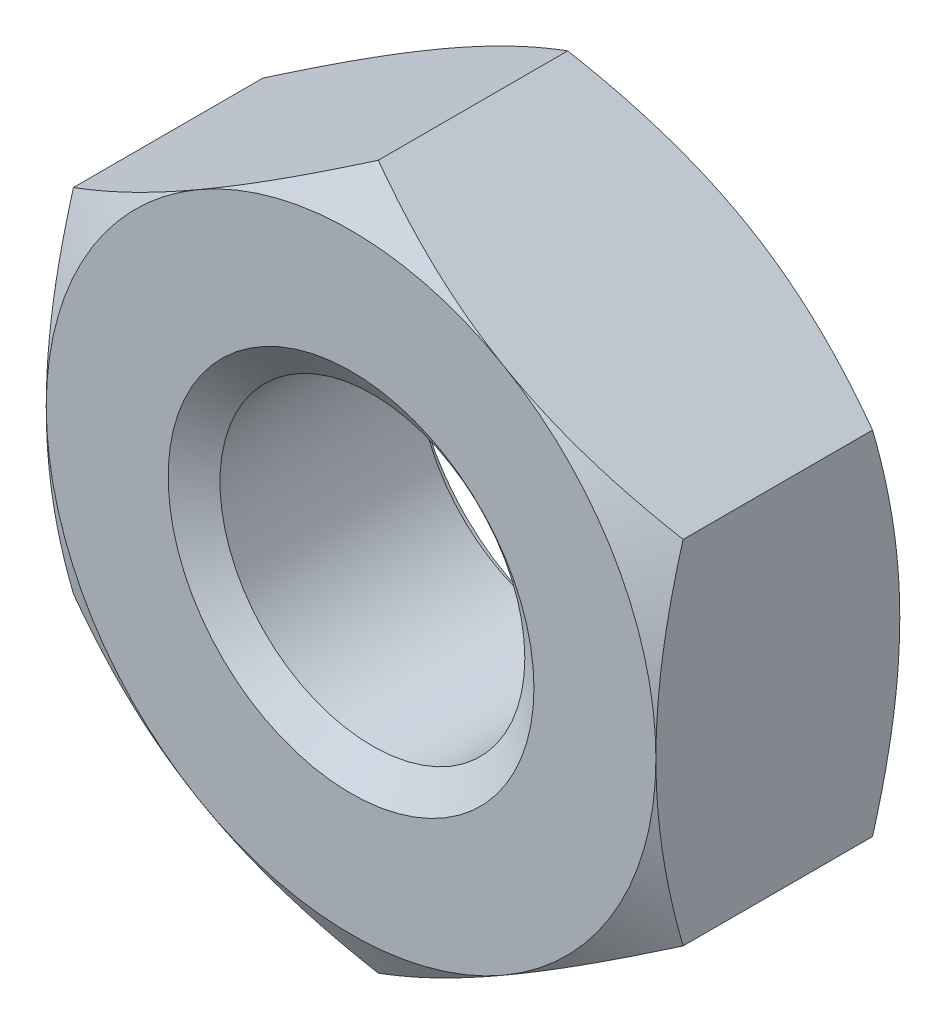
ISO-10303-21;
HEADER;
FILE_DESCRIPTION(('STEP AP214'),'2;1');
FILE_NAME('part.step','',(''),(''),'','','');
FILE_SCHEMA(('AUTOMOTIVE_DESIGN { 1 0 10303 214 1 1 1 1 }'));
ENDSEC;
DATA;
#1=APPLICATION_CONTEXT('core data for automotive mechanical design processes');
#2=APPLICATION_PROTOCOL_DEFINITION('international standard','automotive_design',2000,#1);
#3=PRODUCT_CONTEXT('',#1,'mechanical');
#4=PRODUCT('Part','Part','',(#3));
#5=PRODUCT_RELATED_PRODUCT_CATEGORY('part','',(#4));
#6=PRODUCT_DEFINITION_FORMATION('','',#4);
#7=PRODUCT_DEFINITION_CONTEXT('part definition',#1,'design');
#8=PRODUCT_DEFINITION('design','',#6,#7);
#9=PRODUCT_DEFINITION_SHAPE('','',#8);
#10=(LENGTH_UNIT() NAMED_UNIT(*) SI_UNIT(.MILLI.,.METRE.));
#11=(NAMED_UNIT(*) PLANE_ANGLE_UNIT() SI_UNIT($,.RADIAN.));
#12=(NAMED_UNIT(*) SI_UNIT($,.STERADIAN.) SOLID_ANGLE_UNIT());
#13=UNCERTAINTY_MEASURE_WITH_UNIT(LENGTH_MEASURE(1.E-05),#10,'distance_accuracy_value','');
#14=(GEOMETRIC_REPRESENTATION_CONTEXT(3) GLOBAL_UNCERTAINTY_ASSIGNED_CONTEXT((#13)) GLOBAL_UNIT_ASSIGNED_CONTEXT((#10,
#11,#12)) REPRESENTATION_CONTEXT('',''));
#15=CARTESIAN_POINT('',(0.,0.,0.));
#16=DIRECTION('',(0.,0.,1.));
#17=DIRECTION('',(1.,0.,0.));
#18=AXIS2_PLACEMENT_3D('',#15,#16,#17);
#19=CARTESIAN_POINT('',(0.,0.,-2.));
#20=DIRECTION('',(0.,0.,1.));
#21=DIRECTION('',(1.,0.,0.));
#22=AXIS2_PLACEMENT_3D('',#19,#20,#21);
#23=CYLINDRICAL_SURFACE('',#22,1.25);
#24=CARTESIAN_POINT('',(0.,0.,-0.175051884552426));
#25=DIRECTION('',(0.,0.,1.));
#26=DIRECTION('',(1.,0.,0.));
#27=AXIS2_PLACEMENT_3D('',#24,#25,#26);
#28=CIRCLE('',#27,1.25);
#29=CARTESIAN_POINT('',(1.25,0.,-0.175051884552426));
#30=VERTEX_POINT('',#29);
#31=EDGE_CURVE('E177',#30,#30,#28,.F.);
#32=ORIENTED_EDGE('',*,*,#31,.F.);
#33=EDGE_LOOP('',(#32));
#34=FACE_BOUND('',#33,.T.);
#35=CARTESIAN_POINT('',(0.,0.,-1.79954811544757));
#36=DIRECTION('',(0.,0.,-1.));
#37=DIRECTION('',(-1.,0.,0.));
#38=AXIS2_PLACEMENT_3D('',#35,#36,#37);
#39=CIRCLE('',#38,1.25);
#40=CARTESIAN_POINT('',(-1.25,0.,-1.79954811544757));
#41=VERTEX_POINT('',#40);
#42=EDGE_CURVE('E41',#41,#41,#39,.F.);
#43=ORIENTED_EDGE('',*,*,#42,.F.);
#44=EDGE_LOOP('',(#43));
#45=FACE_BOUND('',#44,.T.);
#46=ADVANCED_FACE('F36',(#34,#45),#23,.F.);
#47=CARTESIAN_POINT('',(0.,2.88675134594813,-2.));
#48=DIRECTION('',(-0.500000000000001,0.866025403784438,0.));
#49=DIRECTION('',(-0.866025403784438,-0.500000000000001,0.));
#50=AXIS2_PLACEMENT_3D('',#47,#48,#49);
#51=PLANE('',#50);
#52=DIRECTION('',(0.,0.,1.));
#53=VECTOR('',#52,1.);
#54=CARTESIAN_POINT('',(-2.5,1.44337567297406,-2.));
#55=LINE('',#54,#53);
#56=CARTESIAN_POINT('',(-2.5,1.44337567297407,-1.7767090063074));
#57=VERTEX_POINT('',#56);
#58=CARTESIAN_POINT('',(-2.5,1.44337567297406,-0.223290993692602));
#59=VERTEX_POINT('',#58);
#60=EDGE_CURVE('E167',#57,#59,#55,.T.);
#61=ORIENTED_EDGE('',*,*,#60,.T.);
#62=CARTESIAN_POINT('',(-2.5002,1.44326020292022,-0.223357664359109));
#63=CARTESIAN_POINT('',(-2.39033676526513,1.50668977106845,-0.186721620107627));
#64=CARTESIAN_POINT('',(-2.27952520010347,1.57066685804385,-0.153402218965057));
#65=CARTESIAN_POINT('',(-2.05598316653395,1.69972891130041,-0.0952422855578579));
#66=CARTESIAN_POINT('',(-1.94324872547161,1.7648161711947,-0.0704223291477382));
#67=CARTESIAN_POINT('',(-1.71917700612473,1.8941840386774,-0.0317856514410517));
#68=CARTESIAN_POINT('',(-1.60787420823262,1.95844473900197,-0.0177117961856387));
#69=CARTESIAN_POINT('',(-1.38474477253167,2.08726857876804,-0.000909152352750115));
#70=CARTESIAN_POINT('',(-1.27291894598577,2.15183124982667,0.00183354879637339));
#71=CARTESIAN_POINT('',(-1.06395802444848,2.27247489412634,-0.00386576000805381));
#72=CARTESIAN_POINT('',(-0.966791682442269,2.32857390783979,-0.0109083943818621));
#73=CARTESIAN_POINT('',(-0.773092050288998,2.44040644260542,-0.0332314191249433));
#74=CARTESIAN_POINT('',(-0.676559430340268,2.4961395767184,-0.048519438440268));
#75=CARTESIAN_POINT('',(-0.482460278259524,2.60820277442169,-0.0867390938444216));
#76=CARTESIAN_POINT('',(-0.384918318217859,2.66451865130903,-0.109832776125519));
#77=CARTESIAN_POINT('',(-0.191289391923915,2.77631036402774,-0.162246656577915));
#78=CARTESIAN_POINT('',(-0.0951999441138239,2.83178763258718,-0.191554535624551));
#79=CARTESIAN_POINT('',(0.000200000000000058,2.88686681600197,-0.223357664359111));
#80=B_SPLINE_CURVE_WITH_KNOTS('',3,(#62,#63,#64,#65,#66,#67,#68,#69,#70,#71,#72,#73,#74,#75,#76,
#77,#78,#79),.UNSPECIFIED.,.F.,.F.,(4,2,2,2,2,2,2,2,4),(0.,0.396285827362227,0.793524330152052,
1.18093086852114,1.56786160134475,1.90479741793733,2.24204551660463,2.58677531536756,
2.93082800105257),.UNSPECIFIED.);
#81=CARTESIAN_POINT('',(-1.25,2.1650635094611,0.));
#82=VERTEX_POINT('',#81);
#83=EDGE_CURVE('E63',#59,#82,#80,.T.);
#84=ORIENTED_EDGE('',*,*,#83,.T.);
#85=CARTESIAN_POINT('',(0.,2.88675134594813,-0.223290993692604));
#86=VERTEX_POINT('',#85);
#87=EDGE_CURVE('E246',#82,#86,#80,.T.);
#88=ORIENTED_EDGE('',*,*,#87,.T.);
#89=DIRECTION('',(0.,0.,1.));
#90=VECTOR('',#89,1.);
#91=CARTESIAN_POINT('',(0.,2.88675134594813,-2.));
#92=LINE('',#91,#90);
#93=CARTESIAN_POINT('',(0.,2.88675134594813,-1.7767090063074));
#94=VERTEX_POINT('',#93);
#95=EDGE_CURVE('E152',#94,#86,#92,.T.);
#96=ORIENTED_EDGE('',*,*,#95,.F.);
#97=CARTESIAN_POINT('',(-2.5002,1.44326020292022,-1.77664233564089));
#98=CARTESIAN_POINT('',(-2.39033676526513,1.50668977106845,-1.81327837989237));
#99=CARTESIAN_POINT('',(-2.27952520010348,1.57066685804385,-1.84659778103494));
#100=CARTESIAN_POINT('',(-2.05598316653395,1.69972891130041,-1.90475771444214));
#101=CARTESIAN_POINT('',(-1.94324872547161,1.7648161711947,-1.92957767085226));
#102=CARTESIAN_POINT('',(-1.71917700612473,1.8941840386774,-1.96821434855895));
#103=CARTESIAN_POINT('',(-1.60787420823262,1.95844473900197,-1.98228820381436));
#104=CARTESIAN_POINT('',(-1.38474477253167,2.08726857876804,-1.99909084764725));
#105=CARTESIAN_POINT('',(-1.27291894598577,2.15183124982667,-2.00183354879637));
#106=CARTESIAN_POINT('',(-1.06395802444848,2.27247489412634,-1.99613423999195));
#107=CARTESIAN_POINT('',(-0.966791682442269,2.32857390783979,-1.98909160561814));
#108=CARTESIAN_POINT('',(-0.773092050288998,2.44040644260542,-1.96676858087506));
#109=CARTESIAN_POINT('',(-0.676559430340268,2.4961395767184,-1.95148056155973));
#110=CARTESIAN_POINT('',(-0.482460278259524,2.60820277442169,-1.91326090615558));
#111=CARTESIAN_POINT('',(-0.384918318217859,2.66451865130903,-1.89016722387448));
#112=CARTESIAN_POINT('',(-0.191289391923915,2.77631036402774,-1.83775334342208));
#113=CARTESIAN_POINT('',(-0.095199944113824,2.83178763258718,-1.80844546437545));
#114=CARTESIAN_POINT('',(0.000200000000000049,2.88686681600197,-1.77664233564089));
#115=B_SPLINE_CURVE_WITH_KNOTS('',3,(#97,#98,#99,#100,#101,#102,#103,#104,#105,#106,#107,#108,
#109,#110,#111,#112,#113,#114),.UNSPECIFIED.,.F.,.F.,(4,2,2,2,2,2,2,2,4),(0.,0.396285827362227,
0.793524330152052,1.18093086852114,1.56786160134476,1.90479741793733,2.24204551660463,
2.58677531536756,2.93082800105257),.UNSPECIFIED.);
#116=CARTESIAN_POINT('',(-1.25,2.1650635094611,-2.));
#117=VERTEX_POINT('',#116);
#118=EDGE_CURVE('E170',#117,#94,#115,.T.);
#119=ORIENTED_EDGE('',*,*,#118,.F.);
#120=EDGE_CURVE('E269',#57,#117,#115,.T.);
#121=ORIENTED_EDGE('',*,*,#120,.F.);
#122=EDGE_LOOP('',(#61,#84,#88,#96,#119,#121));
#123=FACE_BOUND('',#122,.T.);
#124=ADVANCED_FACE('F38',(#123),#51,.T.);
#125=CARTESIAN_POINT('',(2.5,1.44337567297406,-2.));
#126=DIRECTION('',(0.500000000000001,0.866025403784438,0.));
#127=DIRECTION('',(-0.866025403784438,0.500000000000001,0.));
#128=AXIS2_PLACEMENT_3D('',#125,#126,#127);
#129=PLANE('',#128);
#130=ORIENTED_EDGE('',*,*,#95,.T.);
#131=CARTESIAN_POINT('',(-0.000200000000000063,2.88686681600197,-0.223357664359111));
#132=CARTESIAN_POINT('',(0.109663234734871,2.82343724785375,-0.186721620107628));
#133=CARTESIAN_POINT('',(0.220474799896526,2.75946016087834,-0.153402218965058));
#134=CARTESIAN_POINT('',(0.44401683346605,2.63039810762178,-0.0952422855578591));
#135=CARTESIAN_POINT('',(0.556751274528389,2.5653108477275,-0.0704223291477395));
#136=CARTESIAN_POINT('',(0.78082299387527,2.43594298024479,-0.0317856514410527));
#137=CARTESIAN_POINT('',(0.892125791767378,2.37168227992023,-0.0177117961856393));
#138=CARTESIAN_POINT('',(1.11525522746833,2.24285844015415,-0.000909152352750227));
#139=CARTESIAN_POINT('',(1.22708105401423,2.17829576909553,0.00183354879637344));
#140=CARTESIAN_POINT('',(1.43604197555152,2.05765212479586,-0.00386576000805338));
#141=CARTESIAN_POINT('',(1.53320831755773,2.0015531110824,-0.0109083943818615));
#142=CARTESIAN_POINT('',(1.726907949711,1.88972057631678,-0.0332314191249424));
#143=CARTESIAN_POINT('',(1.82344056965973,1.8339874422038,-0.0485194384402671));
#144=CARTESIAN_POINT('',(2.01753972174048,1.7219242445005,-0.0867390938444205));
#145=CARTESIAN_POINT('',(2.11508168178214,1.66560836761316,-0.109832776125517));
#146=CARTESIAN_POINT('',(2.30871060807609,1.55381665489445,-0.162246656577914));
#147=CARTESIAN_POINT('',(2.40480005588618,1.49833938633502,-0.191554535624549));
#148=CARTESIAN_POINT('',(2.5002,1.44326020292022,-0.223357664359109));
#149=B_SPLINE_CURVE_WITH_KNOTS('',3,(#131,#132,#133,#134,#135,#136,#137,#138,#139,#140,#141,
#142,#143,#144,#145,#146,#147,#148),.UNSPECIFIED.,.F.,.F.,(4,2,2,2,2,2,2,2,4),(0.,
0.396285827362228,0.793524330152053,1.18093086852114,1.56786160134476,1.90479741793733,
2.24204551660463,2.58677531536756,2.93082800105257),.UNSPECIFIED.);
#150=CARTESIAN_POINT('',(1.25,2.1650635094611,0.));
#151=VERTEX_POINT('',#150);
#152=EDGE_CURVE('E145',#86,#151,#149,.T.);
#153=ORIENTED_EDGE('',*,*,#152,.T.);
#154=CARTESIAN_POINT('',(2.5,1.44337567297407,-0.223290993692604));
#155=VERTEX_POINT('',#154);
#156=EDGE_CURVE('E131',#151,#155,#149,.T.);
#157=ORIENTED_EDGE('',*,*,#156,.T.);
#158=DIRECTION('',(0.,0.,1.));
#159=VECTOR('',#158,1.);
#160=CARTESIAN_POINT('',(2.5,1.44337567297406,-2.));
#161=LINE('',#160,#159);
#162=CARTESIAN_POINT('',(2.5,1.44337567297407,-1.7767090063074));
#163=VERTEX_POINT('',#162);
#164=EDGE_CURVE('E144',#163,#155,#161,.T.);
#165=ORIENTED_EDGE('',*,*,#164,.F.);
#166=CARTESIAN_POINT('',(-0.000200000000000063,2.88686681600197,-1.77664233564089));
#167=CARTESIAN_POINT('',(0.109663234734871,2.82343724785375,-1.81327837989237));
#168=CARTESIAN_POINT('',(0.220474799896526,2.75946016087834,-1.84659778103494));
#169=CARTESIAN_POINT('',(0.44401683346605,2.63039810762178,-1.90475771444214));
#170=CARTESIAN_POINT('',(0.556751274528389,2.5653108477275,-1.92957767085226));
#171=CARTESIAN_POINT('',(0.780822993875269,2.43594298024479,-1.96821434855895));
#172=CARTESIAN_POINT('',(0.892125791767378,2.37168227992023,-1.98228820381436));
#173=CARTESIAN_POINT('',(1.11525522746833,2.24285844015415,-1.99909084764725));
#174=CARTESIAN_POINT('',(1.22708105401423,2.17829576909553,-2.00183354879637));
#175=CARTESIAN_POINT('',(1.43604197555152,2.05765212479586,-1.99613423999195));
#176=CARTESIAN_POINT('',(1.53320831755773,2.0015531110824,-1.98909160561814));
#177=CARTESIAN_POINT('',(1.726907949711,1.88972057631678,-1.96676858087506));
#178=CARTESIAN_POINT('',(1.82344056965973,1.8339874422038,-1.95148056155973));
#179=CARTESIAN_POINT('',(2.01753972174048,1.7219242445005,-1.91326090615558));
#180=CARTESIAN_POINT('',(2.11508168178214,1.66560836761316,-1.89016722387448));
#181=CARTESIAN_POINT('',(2.30871060807609,1.55381665489445,-1.83775334342209));
#182=CARTESIAN_POINT('',(2.40480005588618,1.49833938633502,-1.80844546437545));
#183=CARTESIAN_POINT('',(2.5002,1.44326020292022,-1.77664233564089));
#184=B_SPLINE_CURVE_WITH_KNOTS('',3,(#166,#167,#168,#169,#170,#171,#172,#173,#174,#175,#176,
#177,#178,#179,#180,#181,#182,#183),.UNSPECIFIED.,.F.,.F.,(4,2,2,2,2,2,2,2,4),(0.,
0.396285827362228,0.793524330152053,1.18093086852114,1.56786160134476,1.90479741793733,
2.24204551660463,2.58677531536756,2.93082800105257),.UNSPECIFIED.);
#185=CARTESIAN_POINT('',(1.25,2.1650635094611,-2.));
#186=VERTEX_POINT('',#185);
#187=EDGE_CURVE('E262',#186,#163,#184,.T.);
#188=ORIENTED_EDGE('',*,*,#187,.F.);
#189=EDGE_CURVE('E268',#94,#186,#184,.T.);
#190=ORIENTED_EDGE('',*,*,#189,.F.);
#191=EDGE_LOOP('',(#130,#153,#157,#165,#188,#190));
#192=FACE_BOUND('',#191,.T.);
#193=ADVANCED_FACE('F142',(#192),#129,.T.);
#194=CARTESIAN_POINT('',(2.5,1.44337567297406,-2.));
#195=DIRECTION('',(-1.,0.,0.));
#196=DIRECTION('',(0.,0.,1.));
#197=AXIS2_PLACEMENT_3D('',#194,#195,#196);
#198=PLANE('',#197);
#199=CARTESIAN_POINT('',(2.5,-3.82804499372433,-1.1963167632754));
#200=CARTESIAN_POINT('',(2.5,-3.71828085649173,-1.14327266922931));
#201=CARTESIAN_POINT('',(2.5,-3.60825720059554,-1.09075587737963));
#202=CARTESIAN_POINT('',(2.5,-3.38755052986222,-0.987078216748229));
#203=CARTESIAN_POINT('',(2.5,-3.27686740487455,-0.935917582729521));
#204=CARTESIAN_POINT('',(2.5,-3.05410357303959,-0.834984039411599));
#205=CARTESIAN_POINT('',(2.5,-2.94201849305851,-0.7852207469144));
#206=CARTESIAN_POINT('',(2.5,-2.71692709217039,-0.687831615887687));
#207=CARTESIAN_POINT('',(2.5,-2.60392081964711,-0.640205665942513));
#208=CARTESIAN_POINT('',(2.5,-2.37540441715611,-0.547094156496477));
#209=CARTESIAN_POINT('',(2.5,-2.25988058014231,-0.501642052634904));
#210=CARTESIAN_POINT('',(2.5,-2.02747029246855,-0.414297644349638));
#211=CARTESIAN_POINT('',(2.5,-1.91058369184876,-0.372405735979066));
#212=CARTESIAN_POINT('',(2.5,-1.67550198908607,-0.293307342769302));
#213=CARTESIAN_POINT('',(2.5,-1.5573102732053,-0.256090896739899));
#214=CARTESIAN_POINT('',(2.5,-1.31924659147407,-0.187552097840317));
#215=CARTESIAN_POINT('',(2.5,-1.19937516991093,-0.15622788104797));
#216=CARTESIAN_POINT('',(2.5,-0.95787020436375,-0.100994246846276));
#217=CARTESIAN_POINT('',(2.5,-0.836236200197811,-0.0770868037228378));
#218=CARTESIAN_POINT('',(2.5,-0.591501703670347,-0.0382963974514648));
#219=CARTESIAN_POINT('',(2.5,-0.46840121001236,-0.023413442282312));
#220=CARTESIAN_POINT('',(2.5,-0.222157493517465,-0.00398863321839781));
#221=CARTESIAN_POINT('',(2.5,-0.0990195694337577,0.000618687975650856));
#222=CARTESIAN_POINT('',(2.5,0.147170053504667,-0.000752541484247311));
#223=CARTESIAN_POINT('',(2.5,0.270221766445128,-0.00672834425959446));
#224=CARTESIAN_POINT('',(2.5,0.480350397015948,-0.0255492091334945));
#225=CARTESIAN_POINT('',(2.5,0.567659136488637,-0.0359433100274439));
#226=CARTESIAN_POINT('',(2.5,0.741602181646858,-0.0613833814666827));
#227=CARTESIAN_POINT('',(2.5,0.828236378756333,-0.0764300856615294));
#228=CARTESIAN_POINT('',(2.5,1.08705653408106,-0.127759419343895));
#229=CARTESIAN_POINT('',(2.5,1.25802931580451,-0.170218054015721));
#230=CARTESIAN_POINT('',(2.5,1.51386408134077,-0.243447724573253));
#231=CARTESIAN_POINT('',(2.5,1.60005960225962,-0.269821213632274));
#232=CARTESIAN_POINT('',(2.5,1.77155099438377,-0.325177862642352));
#233=CARTESIAN_POINT('',(2.5,1.85684744139723,-0.354159222616821));
#234=CARTESIAN_POINT('',(2.5,2.02618400322713,-0.41412856198768));
#235=CARTESIAN_POINT('',(2.5,2.11022848716774,-0.445104328595938));
#236=CARTESIAN_POINT('',(2.5,2.27766538220571,-0.50887397111919));
#237=CARTESIAN_POINT('',(2.5,2.36105751399617,-0.541668581852107));
#238=CARTESIAN_POINT('',(2.5,2.44414811866678,-0.575193129088621));
#239=B_SPLINE_CURVE_WITH_KNOTS('',3,(#199,#200,#201,#202,#203,#204,#205,#206,#207,#208,#209,
#210,#211,#212,#213,#214,#215,#216,#217,#218,#219,#220,#221,#222,#223,#224,#225,#226,#227,#228,
#229,#230,#231,#232,#233,#234,#235,#236,#237,#238),.UNSPECIFIED.,.F.,.F.,(4,2,2,2,2,2,2,2,2,2,2,
2,2,2,2,2,2,2,2,4),(0.,0.365732370332671,0.731527644124545,1.09941621653744,1.46728558928017,
1.83967125623427,2.21209829506681,2.58371790436001,2.9552197586967,3.32682041917403,
3.69842140819258,4.06764803658773,4.43677881037429,4.70042588015951,4.96411454456775,
5.49188432099894,5.76228301186056,6.03249648197686,6.30118900914357,6.56999089095293),.UNSPECIFIED.);
#240=CARTESIAN_POINT('',(2.5,-1.44337567297407,-0.223290993692604));
#241=VERTEX_POINT('',#240);
#242=CARTESIAN_POINT('',(2.5,0.,0.));
#243=VERTEX_POINT('',#242);
#244=EDGE_CURVE('E137',#241,#243,#239,.T.);
#245=ORIENTED_EDGE('',*,*,#244,.F.);
#246=DIRECTION('',(0.,0.,1.));
#247=VECTOR('',#246,1.);
#248=CARTESIAN_POINT('',(2.5,-1.44337567297407,-2.));
#249=LINE('',#248,#247);
#250=CARTESIAN_POINT('',(2.5,-1.44337567297407,-1.7767090063074));
#251=VERTEX_POINT('',#250);
#252=EDGE_CURVE('E153',#251,#241,#249,.T.);
#253=ORIENTED_EDGE('',*,*,#252,.F.);
#254=CARTESIAN_POINT('',(2.5,-3.82804499372433,-0.803683236724597));
#255=CARTESIAN_POINT('',(2.5,-3.71828085649173,-0.856727330770685));
#256=CARTESIAN_POINT('',(2.5,-3.60825720059554,-0.909244122620374));
#257=CARTESIAN_POINT('',(2.5,-3.38755052986222,-1.01292178325177));
#258=CARTESIAN_POINT('',(2.5,-3.27686740487455,-1.06408241727048));
#259=CARTESIAN_POINT('',(2.5,-3.05410357303959,-1.1650159605884));
#260=CARTESIAN_POINT('',(2.5,-2.94201849305851,-1.2147792530856));
#261=CARTESIAN_POINT('',(2.5,-2.7169270921704,-1.31216838411231));
#262=CARTESIAN_POINT('',(2.5,-2.60392081964711,-1.35979433405749));
#263=CARTESIAN_POINT('',(2.5,-2.37540441715611,-1.45290584350352));
#264=CARTESIAN_POINT('',(2.5,-2.25988058014231,-1.4983579473651));
#265=CARTESIAN_POINT('',(2.5,-2.02747029246855,-1.58570235565036));
#266=CARTESIAN_POINT('',(2.5,-1.91058369184876,-1.62759426402093));
#267=CARTESIAN_POINT('',(2.5,-1.67550198908607,-1.7066926572307));
#268=CARTESIAN_POINT('',(2.5,-1.5573102732053,-1.7439091032601));
#269=CARTESIAN_POINT('',(2.5,-1.31924659147407,-1.81244790215968));
#270=CARTESIAN_POINT('',(2.5,-1.19937516991093,-1.84377211895203));
#271=CARTESIAN_POINT('',(2.5,-0.957870204363751,-1.89900575315372));
#272=CARTESIAN_POINT('',(2.5,-0.836236200197811,-1.92291319627716));
#273=CARTESIAN_POINT('',(2.5,-0.591501703670347,-1.96170360254854));
#274=CARTESIAN_POINT('',(2.5,-0.468401210012359,-1.97658655771769));
#275=CARTESIAN_POINT('',(2.5,-0.222157493517465,-1.9960113667816));
#276=CARTESIAN_POINT('',(2.5,-0.0990195694337578,-2.00061868797565));
#277=CARTESIAN_POINT('',(2.5,0.147170053504667,-1.99924745851575));
#278=CARTESIAN_POINT('',(2.5,0.270221766445128,-1.99327165574041));
#279=CARTESIAN_POINT('',(2.5,0.480350397015948,-1.97445079086651));
#280=CARTESIAN_POINT('',(2.5,0.567659136488637,-1.96405668997256));
#281=CARTESIAN_POINT('',(2.5,0.741602181646857,-1.93861661853332));
#282=CARTESIAN_POINT('',(2.5,0.828236378756332,-1.92356991433847));
#283=CARTESIAN_POINT('',(2.5,1.08705653408106,-1.87224058065611));
#284=CARTESIAN_POINT('',(2.5,1.25802931580451,-1.82978194598428));
#285=CARTESIAN_POINT('',(2.5,1.51386408134077,-1.75655227542675));
#286=CARTESIAN_POINT('',(2.5,1.60005960225962,-1.73017878636773));
#287=CARTESIAN_POINT('',(2.5,1.77155099438377,-1.67482213735765));
#288=CARTESIAN_POINT('',(2.5,1.85684744139723,-1.64584077738318));
#289=CARTESIAN_POINT('',(2.5,2.02618400322713,-1.58587143801232));
#290=CARTESIAN_POINT('',(2.5,2.11022848716774,-1.55489567140406));
#291=CARTESIAN_POINT('',(2.5,2.27766538220571,-1.49112602888081));
#292=CARTESIAN_POINT('',(2.5,2.36105751399617,-1.45833141814789));
#293=CARTESIAN_POINT('',(2.5,2.44414811866678,-1.42480687091138));
#294=B_SPLINE_CURVE_WITH_KNOTS('',3,(#254,#255,#256,#257,#258,#259,#260,#261,#262,#263,#264,
#265,#266,#267,#268,#269,#270,#271,#272,#273,#274,#275,#276,#277,#278,#279,#280,#281,#282,#283,
#284,#285,#286,#287,#288,#289,#290,#291,#292,#293),.UNSPECIFIED.,.F.,.F.,(4,2,2,2,2,2,2,2,2,2,2,
2,2,2,2,2,2,2,2,4),(0.,0.36573237033267,0.731527644124544,1.09941621653744,1.46728558928017,
1.83967125623427,2.21209829506681,2.58371790436,2.9552197586967,3.32682041917403,
3.69842140819258,4.06764803658773,4.43677881037429,4.70042588015951,4.96411454456775,
5.49188432099894,5.76228301186056,6.03249648197686,6.30118900914357,6.56999089095293),.UNSPECIFIED.);
#295=CARTESIAN_POINT('',(2.5,0.,-2.));
#296=VERTEX_POINT('',#295);
#297=EDGE_CURVE('E275',#251,#296,#294,.T.);
#298=ORIENTED_EDGE('',*,*,#297,.T.);
#299=EDGE_CURVE('E151',#296,#163,#294,.T.);
#300=ORIENTED_EDGE('',*,*,#299,.T.);
#301=ORIENTED_EDGE('',*,*,#164,.T.);
#302=EDGE_CURVE('E128',#243,#155,#239,.T.);
#303=ORIENTED_EDGE('',*,*,#302,.F.);
#304=EDGE_LOOP('',(#245,#253,#298,#300,#301,#303));
#305=FACE_BOUND('',#304,.T.);
#306=ADVANCED_FACE('F148',(#305),#198,.F.);
#307=CARTESIAN_POINT('',(0.,-2.88675134594814,-2.));
#308=DIRECTION('',(0.500000000000001,-0.866025403784438,0.));
#309=DIRECTION('',(0.866025403784438,0.500000000000001,0.));
#310=AXIS2_PLACEMENT_3D('',#307,#308,#309);
#311=PLANE('',#310);
#312=ORIENTED_EDGE('',*,*,#252,.T.);
#313=CARTESIAN_POINT('',(2.5002,-1.44326020292023,-0.223357664359111));
#314=CARTESIAN_POINT('',(2.39033676526513,-1.50668977106845,-0.186721620107628));
#315=CARTESIAN_POINT('',(2.27952520010347,-1.57066685804386,-0.153402218965058));
#316=CARTESIAN_POINT('',(2.05598316653395,-1.69972891130042,-0.0952422855578597));
#317=CARTESIAN_POINT('',(1.94324872547161,-1.7648161711947,-0.0704223291477402));
#318=CARTESIAN_POINT('',(1.71917700612473,-1.89418403867741,-0.0317856514410541));
#319=CARTESIAN_POINT('',(1.60787420823262,-1.95844473900197,-0.0177117961856413));
#320=CARTESIAN_POINT('',(1.38474477253167,-2.08726857876805,-0.000909152352752912));
#321=CARTESIAN_POINT('',(1.27291894598577,-2.15183124982667,0.00183354879637053));
#322=CARTESIAN_POINT('',(1.06395802444848,-2.27247489412634,-0.00386576000805681));
#323=CARTESIAN_POINT('',(0.966791682442268,-2.3285739078398,-0.0109083943818652));
#324=CARTESIAN_POINT('',(0.773092050288997,-2.44040644260542,-0.0332314191249465));
#325=CARTESIAN_POINT('',(0.676559430340267,-2.4961395767184,-0.0485194384402713));
#326=CARTESIAN_POINT('',(0.482460278259523,-2.6082027744217,-0.086739093844425));
#327=CARTESIAN_POINT('',(0.384918318217859,-2.66451865130904,-0.109832776125522));
#328=CARTESIAN_POINT('',(0.191289391923915,-2.77631036402775,-0.162246656577919));
#329=CARTESIAN_POINT('',(0.0951999441138238,-2.83178763258718,-0.191554535624554));
#330=CARTESIAN_POINT('',(-0.000200000000000236,-2.88686681600198,-0.223357664359114));
#331=B_SPLINE_CURVE_WITH_KNOTS('',3,(#313,#314,#315,#316,#317,#318,#319,#320,#321,#322,#323,
#324,#325,#326,#327,#328,#329,#330),.UNSPECIFIED.,.F.,.F.,(4,2,2,2,2,2,2,2,4),(0.,
0.396285827362227,0.793524330152052,1.18093086852114,1.56786160134476,1.90479741793733,
2.24204551660463,2.58677531536756,2.93082800105257),.UNSPECIFIED.);
#332=CARTESIAN_POINT('',(1.25,-2.1650635094611,0.));
#333=VERTEX_POINT('',#332);
#334=EDGE_CURVE('E550',#241,#333,#331,.T.);
#335=ORIENTED_EDGE('',*,*,#334,.T.);
#336=CARTESIAN_POINT('',(0.,-2.88675134594813,-0.223290993692604));
#337=VERTEX_POINT('',#336);
#338=EDGE_CURVE('E230',#333,#337,#331,.T.);
#339=ORIENTED_EDGE('',*,*,#338,.T.);
#340=DIRECTION('',(0.,0.,1.));
#341=VECTOR('',#340,1.);
#342=CARTESIAN_POINT('',(0.,-2.88675134594814,-2.));
#343=LINE('',#342,#341);
#344=CARTESIAN_POINT('',(0.,-2.88675134594813,-1.7767090063074));
#345=VERTEX_POINT('',#344);
#346=EDGE_CURVE('E158',#345,#337,#343,.T.);
#347=ORIENTED_EDGE('',*,*,#346,.F.);
#348=CARTESIAN_POINT('',(2.5002,-1.44326020292023,-1.77664233564089));
#349=CARTESIAN_POINT('',(2.39033676526513,-1.50668977106845,-1.81327837989237));
#350=CARTESIAN_POINT('',(2.27952520010347,-1.57066685804386,-1.84659778103494));
#351=CARTESIAN_POINT('',(2.05598316653395,-1.69972891130042,-1.90475771444214));
#352=CARTESIAN_POINT('',(1.94324872547161,-1.7648161711947,-1.92957767085226));
#353=CARTESIAN_POINT('',(1.71917700612473,-1.89418403867741,-1.96821434855895));
#354=CARTESIAN_POINT('',(1.60787420823262,-1.95844473900197,-1.98228820381436));
#355=CARTESIAN_POINT('',(1.38474477253167,-2.08726857876805,-1.99909084764725));
#356=CARTESIAN_POINT('',(1.27291894598577,-2.15183124982667,-2.00183354879637));
#357=CARTESIAN_POINT('',(1.06395802444848,-2.27247489412634,-1.99613423999194));
#358=CARTESIAN_POINT('',(0.966791682442268,-2.3285739078398,-1.98909160561814));
#359=CARTESIAN_POINT('',(0.773092050288997,-2.44040644260542,-1.96676858087505));
#360=CARTESIAN_POINT('',(0.676559430340267,-2.4961395767184,-1.95148056155973));
#361=CARTESIAN_POINT('',(0.482460278259524,-2.6082027744217,-1.91326090615557));
#362=CARTESIAN_POINT('',(0.384918318217859,-2.66451865130904,-1.89016722387448));
#363=CARTESIAN_POINT('',(0.191289391923915,-2.77631036402775,-1.83775334342208));
#364=CARTESIAN_POINT('',(0.0951999441138239,-2.83178763258718,-1.80844546437545));
#365=CARTESIAN_POINT('',(-0.000200000000000239,-2.88686681600198,-1.77664233564089));
#366=B_SPLINE_CURVE_WITH_KNOTS('',3,(#348,#349,#350,#351,#352,#353,#354,#355,#356,#357,#358,
#359,#360,#361,#362,#363,#364,#365),.UNSPECIFIED.,.F.,.F.,(4,2,2,2,2,2,2,2,4),(0.,
0.396285827362227,0.793524330152052,1.18093086852114,1.56786160134476,1.90479741793733,
2.24204551660463,2.58677531536756,2.93082800105257),.UNSPECIFIED.);
#367=CARTESIAN_POINT('',(1.25,-2.1650635094611,-2.));
#368=VERTEX_POINT('',#367);
#369=EDGE_CURVE('E282',#368,#345,#366,.T.);
#370=ORIENTED_EDGE('',*,*,#369,.F.);
#371=EDGE_CURVE('E281',#251,#368,#366,.T.);
#372=ORIENTED_EDGE('',*,*,#371,.F.);
#373=EDGE_LOOP('',(#312,#335,#339,#347,#370,#372));
#374=FACE_BOUND('',#373,.T.);
#375=ADVANCED_FACE('F294',(#374),#311,.T.);
#376=CARTESIAN_POINT('',(-2.5,-1.44337567297407,-2.));
#377=DIRECTION('',(-0.500000000000001,-0.866025403784438,0.));
#378=DIRECTION('',(0.866025403784438,-0.500000000000001,0.));
#379=AXIS2_PLACEMENT_3D('',#376,#377,#378);
#380=PLANE('',#379);
#381=ORIENTED_EDGE('',*,*,#346,.T.);
#382=CARTESIAN_POINT('',(0.0002,-2.88686681600198,-0.223357664359114));
#383=CARTESIAN_POINT('',(-0.109663234734872,-2.82343724785375,-0.186721620107632));
#384=CARTESIAN_POINT('',(-0.220474799896526,-2.75946016087835,-0.153402218965061));
#385=CARTESIAN_POINT('',(-0.444016833466051,-2.63039810762179,-0.0952422855578623));
#386=CARTESIAN_POINT('',(-0.55675127452839,-2.5653108477275,-0.0704223291477424));
#387=CARTESIAN_POINT('',(-0.780822993875271,-2.4359429802448,-0.0317856514410556));
#388=CARTESIAN_POINT('',(-0.89212579176738,-2.37168227992023,-0.0177117961856423));
#389=CARTESIAN_POINT('',(-1.11525522746834,-2.24285844015415,-0.000909152352753159));
#390=CARTESIAN_POINT('',(-1.22708105401423,-2.17829576909553,0.00183354879637057));
#391=CARTESIAN_POINT('',(-1.43604197555152,-2.05765212479586,-0.00386576000805637));
#392=CARTESIAN_POINT('',(-1.53320831755773,-2.0015531110824,-0.0109083943818646));
#393=CARTESIAN_POINT('',(-1.72690794971101,-1.88972057631678,-0.0332314191249453));
#394=CARTESIAN_POINT('',(-1.82344056965973,-1.8339874422038,-0.0485194384402697));
#395=CARTESIAN_POINT('',(-2.01753972174048,-1.72192424450051,-0.0867390938444228));
#396=CARTESIAN_POINT('',(-2.11508168178214,-1.66560836761317,-0.10983277612552));
#397=CARTESIAN_POINT('',(-2.30871060807609,-1.55381665489446,-0.162246656577916));
#398=CARTESIAN_POINT('',(-2.40480005588618,-1.49833938633502,-0.191554535624551));
#399=CARTESIAN_POINT('',(-2.5002,-1.44326020292023,-0.223357664359111));
#400=B_SPLINE_CURVE_WITH_KNOTS('',3,(#382,#383,#384,#385,#386,#387,#388,#389,#390,#391,#392,
#393,#394,#395,#396,#397,#398,#399),.UNSPECIFIED.,.F.,.F.,(4,2,2,2,2,2,2,2,4),(0.,
0.396285827362229,0.793524330152054,1.18093086852115,1.56786160134476,1.90479741793734,
2.24204551660463,2.58677531536756,2.93082800105257),.UNSPECIFIED.);
#401=CARTESIAN_POINT('',(-1.25,-2.1650635094611,0.));
#402=VERTEX_POINT('',#401);
#403=EDGE_CURVE('E548',#337,#402,#400,.T.);
#404=ORIENTED_EDGE('',*,*,#403,.T.);
#405=CARTESIAN_POINT('',(-2.5,-1.44337567297407,-0.223290993692604));
#406=VERTEX_POINT('',#405);
#407=EDGE_CURVE('E202',#402,#406,#400,.T.);
#408=ORIENTED_EDGE('',*,*,#407,.T.);
#409=DIRECTION('',(0.,0.,1.));
#410=VECTOR('',#409,1.);
#411=CARTESIAN_POINT('',(-2.5,-1.44337567297407,-2.));
#412=LINE('',#411,#410);
#413=CARTESIAN_POINT('',(-2.5,-1.44337567297407,-1.7767090063074));
#414=VERTEX_POINT('',#413);
#415=EDGE_CURVE('E164',#414,#406,#412,.T.);
#416=ORIENTED_EDGE('',*,*,#415,.F.);
#417=CARTESIAN_POINT('',(0.0002,-2.88686681600198,-1.77664233564089));
#418=CARTESIAN_POINT('',(-0.109663234734872,-2.82343724785375,-1.81327837989237));
#419=CARTESIAN_POINT('',(-0.220474799896526,-2.75946016087835,-1.84659778103494));
#420=CARTESIAN_POINT('',(-0.444016833466051,-2.63039810762179,-1.90475771444214));
#421=CARTESIAN_POINT('',(-0.55675127452839,-2.5653108477275,-1.92957767085226));
#422=CARTESIAN_POINT('',(-0.780822993875271,-2.4359429802448,-1.96821434855894));
#423=CARTESIAN_POINT('',(-0.89212579176738,-2.37168227992023,-1.98228820381436));
#424=CARTESIAN_POINT('',(-1.11525522746834,-2.24285844015415,-1.99909084764725));
#425=CARTESIAN_POINT('',(-1.22708105401423,-2.17829576909553,-2.00183354879637));
#426=CARTESIAN_POINT('',(-1.43604197555152,-2.05765212479586,-1.99613423999194));
#427=CARTESIAN_POINT('',(-1.53320831755773,-2.0015531110824,-1.98909160561814));
#428=CARTESIAN_POINT('',(-1.72690794971101,-1.88972057631678,-1.96676858087505));
#429=CARTESIAN_POINT('',(-1.82344056965973,-1.8339874422038,-1.95148056155973));
#430=CARTESIAN_POINT('',(-2.01753972174048,-1.72192424450051,-1.91326090615558));
#431=CARTESIAN_POINT('',(-2.11508168178214,-1.66560836761317,-1.89016722387448));
#432=CARTESIAN_POINT('',(-2.30871060807609,-1.55381665489446,-1.83775334342208));
#433=CARTESIAN_POINT('',(-2.40480005588618,-1.49833938633502,-1.80844546437545));
#434=CARTESIAN_POINT('',(-2.5002,-1.44326020292023,-1.77664233564089));
#435=B_SPLINE_CURVE_WITH_KNOTS('',3,(#417,#418,#419,#420,#421,#422,#423,#424,#425,#426,#427,
#428,#429,#430,#431,#432,#433,#434),.UNSPECIFIED.,.F.,.F.,(4,2,2,2,2,2,2,2,4),(0.,
0.396285827362229,0.793524330152054,1.18093086852115,1.56786160134476,1.90479741793734,
2.24204551660463,2.58677531536756,2.93082800105257),.UNSPECIFIED.);
#436=CARTESIAN_POINT('',(-1.25,-2.1650635094611,-2.));
#437=VERTEX_POINT('',#436);
#438=EDGE_CURVE('E289',#437,#414,#435,.T.);
#439=ORIENTED_EDGE('',*,*,#438,.F.);
#440=EDGE_CURVE('E288',#345,#437,#435,.T.);
#441=ORIENTED_EDGE('',*,*,#440,.F.);
#442=EDGE_LOOP('',(#381,#404,#408,#416,#439,#441));
#443=FACE_BOUND('',#442,.T.);
#444=ADVANCED_FACE('F297',(#443),#380,.T.);
#445=CARTESIAN_POINT('',(-2.5,1.44337567297406,-2.));
#446=DIRECTION('',(-1.,0.,0.));
#447=DIRECTION('',(0.,0.,1.));
#448=AXIS2_PLACEMENT_3D('',#445,#446,#447);
#449=PLANE('',#448);
#450=ORIENTED_EDGE('',*,*,#415,.T.);
#451=CARTESIAN_POINT('',(-2.5,-3.82804499372433,-1.1963167632754));
#452=CARTESIAN_POINT('',(-2.5,-3.71828085649173,-1.14327266922931));
#453=CARTESIAN_POINT('',(-2.5,-3.60825720059554,-1.09075587737963));
#454=CARTESIAN_POINT('',(-2.5,-3.38755052986222,-0.987078216748229));
#455=CARTESIAN_POINT('',(-2.5,-3.27686740487455,-0.935917582729521));
#456=CARTESIAN_POINT('',(-2.5,-3.05410357303959,-0.834984039411599));
#457=CARTESIAN_POINT('',(-2.5,-2.94201849305851,-0.7852207469144));
#458=CARTESIAN_POINT('',(-2.5,-2.71692709217039,-0.687831615887687));
#459=CARTESIAN_POINT('',(-2.5,-2.60392081964711,-0.640205665942513));
#460=CARTESIAN_POINT('',(-2.5,-2.37540441715611,-0.547094156496477));
#461=CARTESIAN_POINT('',(-2.5,-2.25988058014231,-0.501642052634904));
#462=CARTESIAN_POINT('',(-2.5,-2.02747029246855,-0.414297644349638));
#463=CARTESIAN_POINT('',(-2.5,-1.91058369184876,-0.372405735979066));
#464=CARTESIAN_POINT('',(-2.5,-1.67550198908607,-0.293307342769302));
#465=CARTESIAN_POINT('',(-2.5,-1.5573102732053,-0.256090896739899));
#466=CARTESIAN_POINT('',(-2.5,-1.31924659147407,-0.187552097840317));
#467=CARTESIAN_POINT('',(-2.5,-1.19937516991093,-0.15622788104797));
#468=CARTESIAN_POINT('',(-2.5,-0.95787020436375,-0.100994246846276));
#469=CARTESIAN_POINT('',(-2.5,-0.836236200197811,-0.0770868037228378));
#470=CARTESIAN_POINT('',(-2.5,-0.591501703670347,-0.0382963974514648));
#471=CARTESIAN_POINT('',(-2.5,-0.46840121001236,-0.023413442282312));
#472=CARTESIAN_POINT('',(-2.5,-0.222157493517465,-0.00398863321839781));
#473=CARTESIAN_POINT('',(-2.5,-0.0990195694337577,0.000618687975650856));
#474=CARTESIAN_POINT('',(-2.5,0.147170053504667,-0.000752541484247311));
#475=CARTESIAN_POINT('',(-2.5,0.270221766445128,-0.00672834425959446));
#476=CARTESIAN_POINT('',(-2.5,0.480350397015948,-0.0255492091334945));
#477=CARTESIAN_POINT('',(-2.5,0.567659136488637,-0.0359433100274439));
#478=CARTESIAN_POINT('',(-2.5,0.741602181646858,-0.0613833814666827));
#479=CARTESIAN_POINT('',(-2.5,0.828236378756333,-0.0764300856615294));
#480=CARTESIAN_POINT('',(-2.5,1.08705653408106,-0.127759419343895));
#481=CARTESIAN_POINT('',(-2.5,1.25802931580451,-0.170218054015721));
#482=CARTESIAN_POINT('',(-2.5,1.51386408134077,-0.243447724573253));
#483=CARTESIAN_POINT('',(-2.5,1.60005960225962,-0.269821213632274));
#484=CARTESIAN_POINT('',(-2.5,1.77155099438377,-0.325177862642352));
#485=CARTESIAN_POINT('',(-2.5,1.85684744139723,-0.354159222616821));
#486=CARTESIAN_POINT('',(-2.5,2.02618400322713,-0.41412856198768));
#487=CARTESIAN_POINT('',(-2.5,2.11022848716774,-0.445104328595938));
#488=CARTESIAN_POINT('',(-2.5,2.27766538220571,-0.50887397111919));
#489=CARTESIAN_POINT('',(-2.5,2.36105751399617,-0.541668581852107));
#490=CARTESIAN_POINT('',(-2.5,2.44414811866678,-0.575193129088621));
#491=B_SPLINE_CURVE_WITH_KNOTS('',3,(#451,#452,#453,#454,#455,#456,#457,#458,#459,#460,#461,
#462,#463,#464,#465,#466,#467,#468,#469,#470,#471,#472,#473,#474,#475,#476,#477,#478,#479,#480,
#481,#482,#483,#484,#485,#486,#487,#488,#489,#490),.UNSPECIFIED.,.F.,.F.,(4,2,2,2,2,2,2,2,2,2,2,
2,2,2,2,2,2,2,2,4),(0.,0.365732370332671,0.731527644124545,1.09941621653744,1.46728558928017,
1.83967125623427,2.21209829506681,2.58371790436001,2.9552197586967,3.32682041917403,
3.69842140819258,4.06764803658773,4.43677881037429,4.70042588015951,4.96411454456775,
5.49188432099894,5.76228301186056,6.03249648197686,6.30118900914357,6.56999089095293),.UNSPECIFIED.);
#492=CARTESIAN_POINT('',(-2.5,0.,0.));
#493=VERTEX_POINT('',#492);
#494=EDGE_CURVE('E201',#406,#493,#491,.T.);
#495=ORIENTED_EDGE('',*,*,#494,.T.);
#496=EDGE_CURVE('E194',#493,#59,#491,.T.);
#497=ORIENTED_EDGE('',*,*,#496,.T.);
#498=ORIENTED_EDGE('',*,*,#60,.F.);
#499=CARTESIAN_POINT('',(-2.5,-3.82804499372433,-0.803683236724597));
#500=CARTESIAN_POINT('',(-2.5,-3.71828085649173,-0.856727330770685));
#501=CARTESIAN_POINT('',(-2.5,-3.60825720059554,-0.909244122620374));
#502=CARTESIAN_POINT('',(-2.5,-3.38755052986222,-1.01292178325177));
#503=CARTESIAN_POINT('',(-2.5,-3.27686740487455,-1.06408241727048));
#504=CARTESIAN_POINT('',(-2.5,-3.05410357303959,-1.1650159605884));
#505=CARTESIAN_POINT('',(-2.5,-2.94201849305851,-1.2147792530856));
#506=CARTESIAN_POINT('',(-2.5,-2.7169270921704,-1.31216838411231));
#507=CARTESIAN_POINT('',(-2.5,-2.60392081964711,-1.35979433405749));
#508=CARTESIAN_POINT('',(-2.5,-2.37540441715611,-1.45290584350352));
#509=CARTESIAN_POINT('',(-2.5,-2.25988058014231,-1.4983579473651));
#510=CARTESIAN_POINT('',(-2.5,-2.02747029246855,-1.58570235565036));
#511=CARTESIAN_POINT('',(-2.5,-1.91058369184876,-1.62759426402093));
#512=CARTESIAN_POINT('',(-2.5,-1.67550198908607,-1.7066926572307));
#513=CARTESIAN_POINT('',(-2.5,-1.5573102732053,-1.7439091032601));
#514=CARTESIAN_POINT('',(-2.5,-1.31924659147407,-1.81244790215968));
#515=CARTESIAN_POINT('',(-2.5,-1.19937516991093,-1.84377211895203));
#516=CARTESIAN_POINT('',(-2.5,-0.957870204363751,-1.89900575315372));
#517=CARTESIAN_POINT('',(-2.5,-0.836236200197811,-1.92291319627716));
#518=CARTESIAN_POINT('',(-2.5,-0.591501703670347,-1.96170360254854));
#519=CARTESIAN_POINT('',(-2.5,-0.468401210012359,-1.97658655771769));
#520=CARTESIAN_POINT('',(-2.5,-0.222157493517465,-1.9960113667816));
#521=CARTESIAN_POINT('',(-2.5,-0.0990195694337578,-2.00061868797565));
#522=CARTESIAN_POINT('',(-2.5,0.147170053504667,-1.99924745851575));
#523=CARTESIAN_POINT('',(-2.5,0.270221766445128,-1.99327165574041));
#524=CARTESIAN_POINT('',(-2.5,0.480350397015948,-1.97445079086651));
#525=CARTESIAN_POINT('',(-2.5,0.567659136488637,-1.96405668997256));
#526=CARTESIAN_POINT('',(-2.5,0.741602181646857,-1.93861661853332));
#527=CARTESIAN_POINT('',(-2.5,0.828236378756332,-1.92356991433847));
#528=CARTESIAN_POINT('',(-2.5,1.08705653408106,-1.87224058065611));
#529=CARTESIAN_POINT('',(-2.5,1.25802931580451,-1.82978194598428));
#530=CARTESIAN_POINT('',(-2.5,1.51386408134077,-1.75655227542675));
#531=CARTESIAN_POINT('',(-2.5,1.60005960225962,-1.73017878636773));
#532=CARTESIAN_POINT('',(-2.5,1.77155099438377,-1.67482213735765));
#533=CARTESIAN_POINT('',(-2.5,1.85684744139723,-1.64584077738318));
#534=CARTESIAN_POINT('',(-2.5,2.02618400322713,-1.58587143801232));
#535=CARTESIAN_POINT('',(-2.5,2.11022848716774,-1.55489567140406));
#536=CARTESIAN_POINT('',(-2.5,2.27766538220571,-1.49112602888081));
#537=CARTESIAN_POINT('',(-2.5,2.36105751399617,-1.45833141814789));
#538=CARTESIAN_POINT('',(-2.5,2.44414811866678,-1.42480687091138));
#539=B_SPLINE_CURVE_WITH_KNOTS('',3,(#499,#500,#501,#502,#503,#504,#505,#506,#507,#508,#509,
#510,#511,#512,#513,#514,#515,#516,#517,#518,#519,#520,#521,#522,#523,#524,#525,#526,#527,#528,
#529,#530,#531,#532,#533,#534,#535,#536,#537,#538),.UNSPECIFIED.,.F.,.F.,(4,2,2,2,2,2,2,2,2,2,2,
2,2,2,2,2,2,2,2,4),(0.,0.36573237033267,0.731527644124544,1.09941621653744,1.46728558928017,
1.83967125623427,2.21209829506681,2.58371790436,2.9552197586967,3.32682041917403,
3.69842140819258,4.06764803658773,4.43677881037429,4.70042588015951,4.96411454456775,
5.49188432099894,5.76228301186056,6.03249648197686,6.30118900914357,6.56999089095293),.UNSPECIFIED.);
#540=CARTESIAN_POINT('',(-2.5,0.,-2.));
#541=VERTEX_POINT('',#540);
#542=EDGE_CURVE('E336',#541,#57,#539,.T.);
#543=ORIENTED_EDGE('',*,*,#542,.F.);
#544=EDGE_CURVE('E351',#414,#541,#539,.T.);
#545=ORIENTED_EDGE('',*,*,#544,.F.);
#546=EDGE_LOOP('',(#450,#495,#497,#498,#543,#545));
#547=FACE_BOUND('',#546,.T.);
#548=ADVANCED_FACE('F209',(#547),#449,.T.);
#549=CARTESIAN_POINT('',(-4.99999999999999,0.,0.));
#550=DIRECTION('',(0.,0.,1.));
#551=DIRECTION('',(1.,0.,0.));
#552=AXIS2_PLACEMENT_3D('',#549,#550,#551);
#553=PLANE('',#552);
#554=CARTESIAN_POINT('',(0.,0.,0.));
#555=DIRECTION('',(0.,0.,1.));
#556=DIRECTION('',(1.,0.,0.));
#557=AXIS2_PLACEMENT_3D('',#554,#555,#556);
#558=CIRCLE('',#557,1.5);
#559=CARTESIAN_POINT('',(1.5,0.,0.));
#560=VERTEX_POINT('',#559);
#561=EDGE_CURVE('E179',#560,#560,#558,.T.);
#562=ORIENTED_EDGE('',*,*,#561,.F.);
#563=EDGE_LOOP('',(#562));
#564=FACE_BOUND('',#563,.T.);
#565=CARTESIAN_POINT('',(0.,0.,0.));
#566=DIRECTION('',(0.,0.,1.));
#567=DIRECTION('',(1.,0.,0.));
#568=AXIS2_PLACEMENT_3D('',#565,#566,#567);
#569=CIRCLE('',#568,2.5);
#570=EDGE_CURVE('E48',#333,#243,#569,.T.);
#571=ORIENTED_EDGE('',*,*,#570,.T.);
#572=CARTESIAN_POINT('',(0.,0.,0.));
#573=DIRECTION('',(0.,0.,1.));
#574=DIRECTION('',(1.,0.,0.));
#575=AXIS2_PLACEMENT_3D('',#572,#573,#574);
#576=CIRCLE('',#575,2.5);
#577=EDGE_CURVE('E55',#243,#151,#576,.T.);
#578=ORIENTED_EDGE('',*,*,#577,.T.);
#579=EDGE_CURVE('E11',#151,#82,#569,.T.);
#580=ORIENTED_EDGE('',*,*,#579,.T.);
#581=EDGE_CURVE('E46',#82,#493,#569,.T.);
#582=ORIENTED_EDGE('',*,*,#581,.T.);
#583=EDGE_CURVE('E372',#493,#402,#569,.T.);
#584=ORIENTED_EDGE('',*,*,#583,.T.);
#585=EDGE_CURVE('E176',#402,#333,#569,.T.);
#586=ORIENTED_EDGE('',*,*,#585,.T.);
#587=EDGE_LOOP('',(#571,#578,#580,#582,#584,#586));
#588=FACE_BOUND('',#587,.T.);
#589=ADVANCED_FACE('F258',(#564,#588),#553,.T.);
#590=CARTESIAN_POINT('',(-4.99999999999999,0.,-2.));
#591=DIRECTION('',(0.,0.,1.));
#592=DIRECTION('',(1.,0.,0.));
#593=AXIS2_PLACEMENT_3D('',#590,#591,#592);
#594=PLANE('',#593);
#595=CARTESIAN_POINT('',(0.,0.,-2.));
#596=DIRECTION('',(0.,0.,1.));
#597=DIRECTION('',(1.,0.,0.));
#598=AXIS2_PLACEMENT_3D('',#595,#596,#597);
#599=CIRCLE('',#598,1.5);
#600=CARTESIAN_POINT('',(1.5,0.,-2.));
#601=VERTEX_POINT('',#600);
#602=EDGE_CURVE('E180',#601,#601,#599,.F.);
#603=ORIENTED_EDGE('',*,*,#602,.F.);
#604=EDGE_LOOP('',(#603));
#605=FACE_BOUND('',#604,.T.);
#606=CARTESIAN_POINT('',(0.,0.,-2.));
#607=DIRECTION('',(0.,0.,1.));
#608=DIRECTION('',(1.,0.,0.));
#609=AXIS2_PLACEMENT_3D('',#606,#607,#608);
#610=CIRCLE('',#609,2.5);
#611=EDGE_CURVE('E253',#296,#186,#610,.T.);
#612=ORIENTED_EDGE('',*,*,#611,.F.);
#613=CARTESIAN_POINT('',(0.,0.,-2.));
#614=DIRECTION('',(0.,0.,1.));
#615=DIRECTION('',(1.,0.,0.));
#616=AXIS2_PLACEMENT_3D('',#613,#614,#615);
#617=CIRCLE('',#616,2.5);
#618=EDGE_CURVE('E171',#296,#368,#617,.F.);
#619=ORIENTED_EDGE('',*,*,#618,.T.);
#620=EDGE_CURVE('E173',#368,#437,#617,.F.);
#621=ORIENTED_EDGE('',*,*,#620,.T.);
#622=EDGE_CURVE('E381',#437,#541,#617,.F.);
#623=ORIENTED_EDGE('',*,*,#622,.T.);
#624=EDGE_CURVE('E364',#541,#117,#617,.F.);
#625=ORIENTED_EDGE('',*,*,#624,.T.);
#626=EDGE_CURVE('E155',#117,#186,#617,.F.);
#627=ORIENTED_EDGE('',*,*,#626,.T.);
#628=EDGE_LOOP('',(#612,#619,#621,#623,#625,#627));
#629=FACE_BOUND('',#628,.T.);
#630=ADVANCED_FACE('F316',(#605,#629),#594,.F.);
#631=CARTESIAN_POINT('',(0.,0.,-2.));
#632=DIRECTION('',(0.,0.,1.));
#633=DIRECTION('',(1.,0.,0.));
#634=AXIS2_PLACEMENT_3D('',#631,#632,#633);
#635=CONICAL_SURFACE('',#634,2.5,1.0471975511966);
#636=ORIENTED_EDGE('',*,*,#187,.T.);
#637=ORIENTED_EDGE('',*,*,#299,.F.);
#638=ORIENTED_EDGE('',*,*,#611,.T.);
#639=EDGE_LOOP('',(#636,#637,#638));
#640=FACE_BOUND('',#639,.T.);
#641=ADVANCED_FACE('F318',(#640),#635,.T.);
#642=ORIENTED_EDGE('',*,*,#118,.T.);
#643=ORIENTED_EDGE('',*,*,#189,.T.);
#644=ORIENTED_EDGE('',*,*,#626,.F.);
#645=EDGE_LOOP('',(#642,#643,#644));
#646=FACE_BOUND('',#645,.T.);
#647=ADVANCED_FACE('F324',(#646),#635,.T.);
#648=ORIENTED_EDGE('',*,*,#120,.T.);
#649=ORIENTED_EDGE('',*,*,#624,.F.);
#650=ORIENTED_EDGE('',*,*,#542,.T.);
#651=EDGE_LOOP('',(#648,#649,#650));
#652=FACE_BOUND('',#651,.T.);
#653=ADVANCED_FACE('F363',(#652),#635,.T.);
#654=ORIENTED_EDGE('',*,*,#438,.T.);
#655=ORIENTED_EDGE('',*,*,#544,.T.);
#656=ORIENTED_EDGE('',*,*,#622,.F.);
#657=EDGE_LOOP('',(#654,#655,#656));
#658=FACE_BOUND('',#657,.T.);
#659=ADVANCED_FACE('F222',(#658),#635,.T.);
#660=ORIENTED_EDGE('',*,*,#369,.T.);
#661=ORIENTED_EDGE('',*,*,#440,.T.);
#662=ORIENTED_EDGE('',*,*,#620,.F.);
#663=EDGE_LOOP('',(#660,#661,#662));
#664=FACE_BOUND('',#663,.T.);
#665=ADVANCED_FACE('F346',(#664),#635,.T.);
#666=ORIENTED_EDGE('',*,*,#371,.T.);
#667=ORIENTED_EDGE('',*,*,#618,.F.);
#668=ORIENTED_EDGE('',*,*,#297,.F.);
#669=EDGE_LOOP('',(#666,#667,#668));
#670=FACE_BOUND('',#669,.T.);
#671=ADVANCED_FACE('F326',(#670),#635,.T.);
#672=CARTESIAN_POINT('',(0.,0.,0.));
#673=DIRECTION('',(0.,0.,-1.));
#674=DIRECTION('',(-1.,0.,0.));
#675=AXIS2_PLACEMENT_3D('',#672,#673,#674);
#676=CONICAL_SURFACE('',#675,2.5,1.0471975511966);
#677=ORIENTED_EDGE('',*,*,#244,.T.);
#678=ORIENTED_EDGE('',*,*,#570,.F.);
#679=ORIENTED_EDGE('',*,*,#334,.F.);
#680=EDGE_LOOP('',(#677,#678,#679));
#681=FACE_BOUND('',#680,.T.);
#682=ADVANCED_FACE('F415',(#681),#676,.T.);
#683=ORIENTED_EDGE('',*,*,#585,.F.);
#684=ORIENTED_EDGE('',*,*,#403,.F.);
#685=ORIENTED_EDGE('',*,*,#338,.F.);
#686=EDGE_LOOP('',(#683,#684,#685));
#687=FACE_BOUND('',#686,.T.);
#688=ADVANCED_FACE('F217',(#687),#676,.T.);
#689=ORIENTED_EDGE('',*,*,#583,.F.);
#690=ORIENTED_EDGE('',*,*,#494,.F.);
#691=ORIENTED_EDGE('',*,*,#407,.F.);
#692=EDGE_LOOP('',(#689,#690,#691));
#693=FACE_BOUND('',#692,.T.);
#694=ADVANCED_FACE('F211',(#693),#676,.T.);
#695=ORIENTED_EDGE('',*,*,#496,.F.);
#696=ORIENTED_EDGE('',*,*,#581,.F.);
#697=ORIENTED_EDGE('',*,*,#83,.F.);
#698=EDGE_LOOP('',(#695,#696,#697));
#699=FACE_BOUND('',#698,.T.);
#700=ADVANCED_FACE('F216',(#699),#676,.T.);
#701=ORIENTED_EDGE('',*,*,#579,.F.);
#702=ORIENTED_EDGE('',*,*,#152,.F.);
#703=ORIENTED_EDGE('',*,*,#87,.F.);
#704=EDGE_LOOP('',(#701,#702,#703));
#705=FACE_BOUND('',#704,.T.);
#706=ADVANCED_FACE('F219',(#705),#676,.T.);
#707=ORIENTED_EDGE('',*,*,#577,.F.);
#708=ORIENTED_EDGE('',*,*,#302,.T.);
#709=ORIENTED_EDGE('',*,*,#156,.F.);
#710=EDGE_LOOP('',(#707,#708,#709));
#711=FACE_BOUND('',#710,.T.);
#712=ADVANCED_FACE('F130',(#711),#676,.T.);
#713=CARTESIAN_POINT('',(0.,0.,-0.192557073007669));
#714=DIRECTION('',(0.,0.,1.));
#715=DIRECTION('',(1.,0.,0.));
#716=AXIS2_PLACEMENT_3D('',#713,#714,#715);
#717=CONICAL_SURFACE('',#716,1.225,0.959931088596885);
#718=ORIENTED_EDGE('',*,*,#561,.T.);
#719=EDGE_LOOP('',(#718));
#720=FACE_BOUND('',#719,.T.);
#721=ORIENTED_EDGE('',*,*,#31,.T.);
#722=EDGE_LOOP('',(#721));
#723=FACE_BOUND('',#722,.T.);
#724=ADVANCED_FACE('F220',(#720,#723),#717,.F.);
#725=CARTESIAN_POINT('',(0.,0.,-1.97459999999999));
#726=DIRECTION('',(0.,0.,-1.));
#727=DIRECTION('',(-1.,0.,0.));
#728=AXIS2_PLACEMENT_3D('',#725,#726,#727);
#729=CONICAL_SURFACE('',#728,1.5,0.959931088596893);
#730=CARTESIAN_POINT('',(0.,0.,-1.97459999999999));
#731=DIRECTION('',(0.,0.,1.));
#732=DIRECTION('',(1.,0.,0.));
#733=AXIS2_PLACEMENT_3D('',#730,#731,#732);
#734=CIRCLE('',#733,1.5);
#735=CARTESIAN_POINT('',(1.5,0.,-1.97459999999999));
#736=VERTEX_POINT('',#735);
#737=EDGE_CURVE('E182',#736,#736,#734,.T.);
#738=ORIENTED_EDGE('',*,*,#737,.F.);
#739=EDGE_LOOP('',(#738));
#740=FACE_BOUND('',#739,.T.);
#741=ORIENTED_EDGE('',*,*,#42,.T.);
#742=EDGE_LOOP('',(#741));
#743=FACE_BOUND('',#742,.T.);
#744=ADVANCED_FACE('F483',(#740,#743),#729,.F.);
#745=CARTESIAN_POINT('',(0.,0.,-25.0375057290932));
#746=DIRECTION('',(0.,0.,1.));
#747=DIRECTION('',(1.,0.,0.));
#748=AXIS2_PLACEMENT_3D('',#745,#746,#747);
#749=CYLINDRICAL_SURFACE('',#748,1.5);
#750=ORIENTED_EDGE('',*,*,#737,.T.);
#751=EDGE_LOOP('',(#750));
#752=FACE_BOUND('',#751,.T.);
#753=ORIENTED_EDGE('',*,*,#602,.T.);
#754=EDGE_LOOP('',(#753));
#755=FACE_BOUND('',#754,.T.);
#756=ADVANCED_FACE('F492',(#752,#755),#749,.F.);
#757=CLOSED_SHELL('',(#46,#124,#193,#306,#375,#444,#548,#589,#630,#641,#647,#653,#659,#665,#671,
#682,#688,#694,#700,#706,#712,#724,#744,#756));
#758=MANIFOLD_SOLID_BREP('B2',#757);
#759=ADVANCED_BREP_SHAPE_REPRESENTATION('',(#18,#758),#14);
#760=SHAPE_DEFINITION_REPRESENTATION(#9,#759);
ENDSEC;
END-ISO-10303-21;
